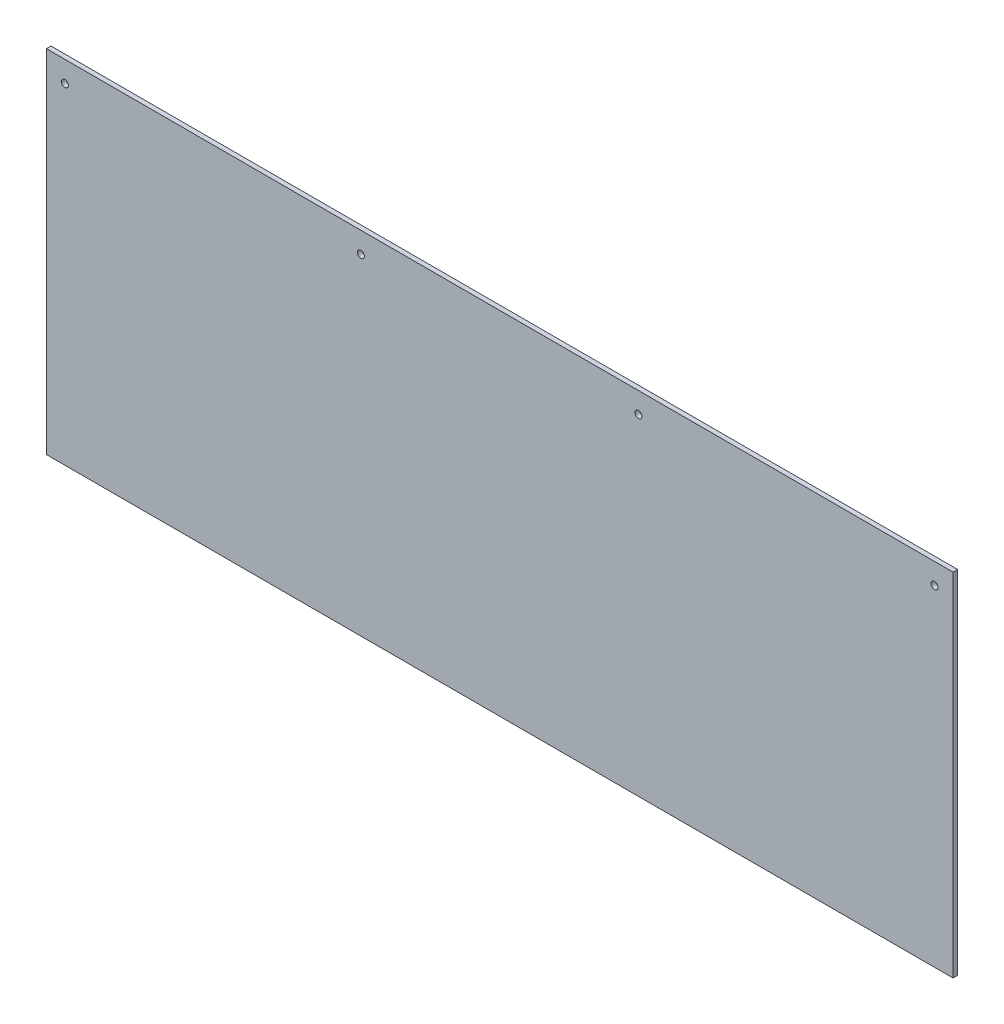
ISO-10303-21;
HEADER;
FILE_DESCRIPTION(('STEP AP214'),'2;1');
FILE_NAME('part.step','',(''),(''),'','','');
FILE_SCHEMA(('AUTOMOTIVE_DESIGN { 1 0 10303 214 1 1 1 1 }'));
ENDSEC;
DATA;
#1=APPLICATION_CONTEXT('core data for automotive mechanical design processes');
#2=APPLICATION_PROTOCOL_DEFINITION('international standard','automotive_design',2000,#1);
#3=PRODUCT_CONTEXT('',#1,'mechanical');
#4=PRODUCT('Part','Part','',(#3));
#5=PRODUCT_RELATED_PRODUCT_CATEGORY('part','',(#4));
#6=PRODUCT_DEFINITION_FORMATION('','',#4);
#7=PRODUCT_DEFINITION_CONTEXT('part definition',#1,'design');
#8=PRODUCT_DEFINITION('design','',#6,#7);
#9=PRODUCT_DEFINITION_SHAPE('','',#8);
#10=(LENGTH_UNIT() NAMED_UNIT(*) SI_UNIT(.MILLI.,.METRE.));
#11=(NAMED_UNIT(*) PLANE_ANGLE_UNIT() SI_UNIT($,.RADIAN.));
#12=(NAMED_UNIT(*) SI_UNIT($,.STERADIAN.) SOLID_ANGLE_UNIT());
#13=UNCERTAINTY_MEASURE_WITH_UNIT(LENGTH_MEASURE(1.E-05),#10,'distance_accuracy_value','');
#14=(GEOMETRIC_REPRESENTATION_CONTEXT(3) GLOBAL_UNCERTAINTY_ASSIGNED_CONTEXT((#13)) GLOBAL_UNIT_ASSIGNED_CONTEXT((#10,
#11,#12)) REPRESENTATION_CONTEXT('',''));
#15=CARTESIAN_POINT('',(0.,0.,0.));
#16=DIRECTION('',(0.,0.,1.));
#17=DIRECTION('',(1.,0.,0.));
#18=AXIS2_PLACEMENT_3D('',#15,#16,#17);
#19=CARTESIAN_POINT('',(0.,0.,6.35));
#20=DIRECTION('',(0.,0.,1.));
#21=DIRECTION('',(1.,0.,0.));
#22=AXIS2_PLACEMENT_3D('',#19,#20,#21);
#23=PLANE('',#22);
#24=CARTESIAN_POINT('',(1219.2,454.025,6.35));
#25=DIRECTION('',(0.,0.,1.));
#26=DIRECTION('',(1.,0.,0.));
#27=AXIS2_PLACEMENT_3D('',#24,#25,#26);
#28=CIRCLE('',#27,4.7625);
#29=CARTESIAN_POINT('',(1223.9625,454.025,6.35));
#30=VERTEX_POINT('',#29);
#31=EDGE_CURVE('E91',#30,#30,#28,.F.);
#32=ORIENTED_EDGE('',*,*,#31,.T.);
#33=EDGE_LOOP('',(#32));
#34=FACE_BOUND('',#33,.T.);
#35=CARTESIAN_POINT('',(812.8,454.025,6.35));
#36=DIRECTION('',(0.,0.,1.));
#37=DIRECTION('',(1.,0.,0.));
#38=AXIS2_PLACEMENT_3D('',#35,#36,#37);
#39=CIRCLE('',#38,4.7625);
#40=CARTESIAN_POINT('',(817.5625,454.025,6.35));
#41=VERTEX_POINT('',#40);
#42=EDGE_CURVE('E94',#41,#41,#39,.F.);
#43=ORIENTED_EDGE('',*,*,#42,.T.);
#44=EDGE_LOOP('',(#43));
#45=FACE_BOUND('',#44,.T.);
#46=CARTESIAN_POINT('',(431.8,454.025,6.35));
#47=DIRECTION('',(0.,0.,1.));
#48=DIRECTION('',(1.,0.,0.));
#49=AXIS2_PLACEMENT_3D('',#46,#47,#48);
#50=CIRCLE('',#49,4.7625);
#51=CARTESIAN_POINT('',(436.5625,454.025,6.35));
#52=VERTEX_POINT('',#51);
#53=EDGE_CURVE('E96',#52,#52,#50,.F.);
#54=ORIENTED_EDGE('',*,*,#53,.T.);
#55=EDGE_LOOP('',(#54));
#56=FACE_BOUND('',#55,.T.);
#57=CARTESIAN_POINT('',(25.4,454.025,6.35));
#58=DIRECTION('',(0.,0.,1.));
#59=DIRECTION('',(1.,0.,0.));
#60=AXIS2_PLACEMENT_3D('',#57,#58,#59);
#61=CIRCLE('',#60,4.7625);
#62=CARTESIAN_POINT('',(30.1625,454.025,6.35));
#63=VERTEX_POINT('',#62);
#64=EDGE_CURVE('E19',#63,#63,#61,.F.);
#65=ORIENTED_EDGE('',*,*,#64,.T.);
#66=EDGE_LOOP('',(#65));
#67=FACE_BOUND('',#66,.T.);
#68=DIRECTION('',(0.,1.,0.));
#69=VECTOR('',#68,1.);
#70=CARTESIAN_POINT('',(0.,482.6,6.35));
#71=LINE('',#70,#69);
#72=CARTESIAN_POINT('',(0.,0.,6.35));
#73=VERTEX_POINT('',#72);
#74=CARTESIAN_POINT('',(0.,482.6,6.35));
#75=VERTEX_POINT('',#74);
#76=EDGE_CURVE('E70',#73,#75,#71,.T.);
#77=ORIENTED_EDGE('',*,*,#76,.F.);
#78=DIRECTION('',(1.,0.,0.));
#79=VECTOR('',#78,1.);
#80=CARTESIAN_POINT('',(0.,0.,6.35));
#81=LINE('',#80,#79);
#82=CARTESIAN_POINT('',(1244.6,0.,6.35));
#83=VERTEX_POINT('',#82);
#84=EDGE_CURVE('E67',#83,#73,#81,.F.);
#85=ORIENTED_EDGE('',*,*,#84,.F.);
#86=DIRECTION('',(0.,1.,0.));
#87=VECTOR('',#86,1.);
#88=CARTESIAN_POINT('',(1244.6,0.,6.35));
#89=LINE('',#88,#87);
#90=CARTESIAN_POINT('',(1244.6,482.6,6.35));
#91=VERTEX_POINT('',#90);
#92=EDGE_CURVE('E58',#91,#83,#89,.F.);
#93=ORIENTED_EDGE('',*,*,#92,.F.);
#94=DIRECTION('',(1.,0.,0.));
#95=VECTOR('',#94,1.);
#96=CARTESIAN_POINT('',(1244.6,482.6,6.35));
#97=LINE('',#96,#95);
#98=EDGE_CURVE('E53',#75,#91,#97,.T.);
#99=ORIENTED_EDGE('',*,*,#98,.F.);
#100=EDGE_LOOP('',(#77,#85,#93,#99));
#101=FACE_BOUND('',#100,.T.);
#102=ADVANCED_FACE('F16',(#34,#45,#56,#67,#101),#23,.T.);
#103=CARTESIAN_POINT('',(0.,0.,0.));
#104=DIRECTION('',(0.,-1.,0.));
#105=DIRECTION('',(0.,0.,-1.));
#106=AXIS2_PLACEMENT_3D('',#103,#104,#105);
#107=PLANE('',#106);
#108=DIRECTION('',(0.,0.,1.));
#109=VECTOR('',#108,1.);
#110=CARTESIAN_POINT('',(0.,0.,0.));
#111=LINE('',#110,#109);
#112=CARTESIAN_POINT('',(0.,0.,0.));
#113=VERTEX_POINT('',#112);
#114=EDGE_CURVE('E104',#113,#73,#111,.T.);
#115=ORIENTED_EDGE('',*,*,#114,.F.);
#116=DIRECTION('',(1.,0.,0.));
#117=VECTOR('',#116,1.);
#118=CARTESIAN_POINT('',(0.,0.,0.));
#119=LINE('',#118,#117);
#120=CARTESIAN_POINT('',(1244.6,0.,0.));
#121=VERTEX_POINT('',#120);
#122=EDGE_CURVE('E77',#113,#121,#119,.T.);
#123=ORIENTED_EDGE('',*,*,#122,.T.);
#124=DIRECTION('',(0.,0.,-1.));
#125=VECTOR('',#124,1.);
#126=CARTESIAN_POINT('',(1244.6,0.,0.));
#127=LINE('',#126,#125);
#128=EDGE_CURVE('E63',#83,#121,#127,.T.);
#129=ORIENTED_EDGE('',*,*,#128,.F.);
#130=ORIENTED_EDGE('',*,*,#84,.T.);
#131=EDGE_LOOP('',(#115,#123,#129,#130));
#132=FACE_BOUND('',#131,.T.);
#133=ADVANCED_FACE('F76',(#132),#107,.T.);
#134=CARTESIAN_POINT('',(1244.6,0.,0.));
#135=DIRECTION('',(1.,0.,0.));
#136=DIRECTION('',(0.,0.,-1.));
#137=AXIS2_PLACEMENT_3D('',#134,#135,#136);
#138=PLANE('',#137);
#139=ORIENTED_EDGE('',*,*,#128,.T.);
#140=DIRECTION('',(0.,1.,0.));
#141=VECTOR('',#140,1.);
#142=CARTESIAN_POINT('',(1244.6,0.,0.));
#143=LINE('',#142,#141);
#144=CARTESIAN_POINT('',(1244.6,482.6,0.));
#145=VERTEX_POINT('',#144);
#146=EDGE_CURVE('E115',#121,#145,#143,.T.);
#147=ORIENTED_EDGE('',*,*,#146,.T.);
#148=DIRECTION('',(0.,0.,1.));
#149=VECTOR('',#148,1.);
#150=CARTESIAN_POINT('',(1244.6,482.6,0.));
#151=LINE('',#150,#149);
#152=EDGE_CURVE('E65',#91,#145,#151,.F.);
#153=ORIENTED_EDGE('',*,*,#152,.F.);
#154=ORIENTED_EDGE('',*,*,#92,.T.);
#155=EDGE_LOOP('',(#139,#147,#153,#154));
#156=FACE_BOUND('',#155,.T.);
#157=ADVANCED_FACE('F60',(#156),#138,.T.);
#158=CARTESIAN_POINT('',(1244.6,482.6,0.));
#159=DIRECTION('',(0.,1.,0.));
#160=DIRECTION('',(0.,0.,1.));
#161=AXIS2_PLACEMENT_3D('',#158,#159,#160);
#162=PLANE('',#161);
#163=ORIENTED_EDGE('',*,*,#152,.T.);
#164=DIRECTION('',(1.,0.,0.));
#165=VECTOR('',#164,1.);
#166=CARTESIAN_POINT('',(0.,482.6,0.));
#167=LINE('',#166,#165);
#168=CARTESIAN_POINT('',(0.,482.6,0.));
#169=VERTEX_POINT('',#168);
#170=EDGE_CURVE('E112',#145,#169,#167,.F.);
#171=ORIENTED_EDGE('',*,*,#170,.T.);
#172=DIRECTION('',(0.,0.,1.));
#173=VECTOR('',#172,1.);
#174=CARTESIAN_POINT('',(0.,482.6,0.));
#175=LINE('',#174,#173);
#176=EDGE_CURVE('E34',#75,#169,#175,.F.);
#177=ORIENTED_EDGE('',*,*,#176,.F.);
#178=ORIENTED_EDGE('',*,*,#98,.T.);
#179=EDGE_LOOP('',(#163,#171,#177,#178));
#180=FACE_BOUND('',#179,.T.);
#181=ADVANCED_FACE('F111',(#180),#162,.T.);
#182=CARTESIAN_POINT('',(0.,482.6,0.));
#183=DIRECTION('',(-1.,0.,0.));
#184=DIRECTION('',(0.,0.,1.));
#185=AXIS2_PLACEMENT_3D('',#182,#183,#184);
#186=PLANE('',#185);
#187=ORIENTED_EDGE('',*,*,#176,.T.);
#188=DIRECTION('',(0.,1.,0.));
#189=VECTOR('',#188,1.);
#190=CARTESIAN_POINT('',(0.,0.,0.));
#191=LINE('',#190,#189);
#192=EDGE_CURVE('E90',#169,#113,#191,.F.);
#193=ORIENTED_EDGE('',*,*,#192,.T.);
#194=ORIENTED_EDGE('',*,*,#114,.T.);
#195=ORIENTED_EDGE('',*,*,#76,.T.);
#196=EDGE_LOOP('',(#187,#193,#194,#195));
#197=FACE_BOUND('',#196,.T.);
#198=ADVANCED_FACE('F118',(#197),#186,.T.);
#199=CARTESIAN_POINT('',(25.4,454.025,0.));
#200=DIRECTION('',(0.,0.,1.));
#201=DIRECTION('',(1.,0.,0.));
#202=AXIS2_PLACEMENT_3D('',#199,#200,#201);
#203=CYLINDRICAL_SURFACE('',#202,4.7625);
#204=ORIENTED_EDGE('',*,*,#64,.F.);
#205=EDGE_LOOP('',(#204));
#206=FACE_BOUND('',#205,.T.);
#207=CARTESIAN_POINT('',(25.4,454.025,0.));
#208=DIRECTION('',(0.,0.,1.));
#209=DIRECTION('',(1.,0.,0.));
#210=AXIS2_PLACEMENT_3D('',#207,#208,#209);
#211=CIRCLE('',#210,4.7625);
#212=CARTESIAN_POINT('',(30.1625,454.025,0.));
#213=VERTEX_POINT('',#212);
#214=EDGE_CURVE('E87',#213,#213,#211,.F.);
#215=ORIENTED_EDGE('',*,*,#214,.T.);
#216=EDGE_LOOP('',(#215));
#217=FACE_BOUND('',#216,.T.);
#218=ADVANCED_FACE('F120',(#206,#217),#203,.F.);
#219=CARTESIAN_POINT('',(431.8,454.025,0.));
#220=DIRECTION('',(0.,0.,1.));
#221=DIRECTION('',(1.,0.,0.));
#222=AXIS2_PLACEMENT_3D('',#219,#220,#221);
#223=CYLINDRICAL_SURFACE('',#222,4.7625);
#224=ORIENTED_EDGE('',*,*,#53,.F.);
#225=EDGE_LOOP('',(#224));
#226=FACE_BOUND('',#225,.T.);
#227=CARTESIAN_POINT('',(431.8,454.025,0.));
#228=DIRECTION('',(0.,0.,1.));
#229=DIRECTION('',(1.,0.,0.));
#230=AXIS2_PLACEMENT_3D('',#227,#228,#229);
#231=CIRCLE('',#230,4.7625);
#232=CARTESIAN_POINT('',(436.5625,454.025,0.));
#233=VERTEX_POINT('',#232);
#234=EDGE_CURVE('E84',#233,#233,#231,.F.);
#235=ORIENTED_EDGE('',*,*,#234,.T.);
#236=EDGE_LOOP('',(#235));
#237=FACE_BOUND('',#236,.T.);
#238=ADVANCED_FACE('F127',(#226,#237),#223,.F.);
#239=CARTESIAN_POINT('',(812.8,454.025,0.));
#240=DIRECTION('',(0.,0.,1.));
#241=DIRECTION('',(1.,0.,0.));
#242=AXIS2_PLACEMENT_3D('',#239,#240,#241);
#243=CYLINDRICAL_SURFACE('',#242,4.7625);
#244=ORIENTED_EDGE('',*,*,#42,.F.);
#245=EDGE_LOOP('',(#244));
#246=FACE_BOUND('',#245,.T.);
#247=CARTESIAN_POINT('',(812.8,454.025,0.));
#248=DIRECTION('',(0.,0.,1.));
#249=DIRECTION('',(1.,0.,0.));
#250=AXIS2_PLACEMENT_3D('',#247,#248,#249);
#251=CIRCLE('',#250,4.7625);
#252=CARTESIAN_POINT('',(817.5625,454.025,0.));
#253=VERTEX_POINT('',#252);
#254=EDGE_CURVE('E25',#253,#253,#251,.F.);
#255=ORIENTED_EDGE('',*,*,#254,.T.);
#256=EDGE_LOOP('',(#255));
#257=FACE_BOUND('',#256,.T.);
#258=ADVANCED_FACE('F138',(#246,#257),#243,.F.);
#259=CARTESIAN_POINT('',(1219.2,454.025,0.));
#260=DIRECTION('',(0.,0.,1.));
#261=DIRECTION('',(1.,0.,0.));
#262=AXIS2_PLACEMENT_3D('',#259,#260,#261);
#263=CYLINDRICAL_SURFACE('',#262,4.7625);
#264=ORIENTED_EDGE('',*,*,#31,.F.);
#265=EDGE_LOOP('',(#264));
#266=FACE_BOUND('',#265,.T.);
#267=CARTESIAN_POINT('',(1219.2,454.025,0.));
#268=DIRECTION('',(0.,0.,1.));
#269=DIRECTION('',(1.,0.,0.));
#270=AXIS2_PLACEMENT_3D('',#267,#268,#269);
#271=CIRCLE('',#270,4.7625);
#272=CARTESIAN_POINT('',(1223.9625,454.025,0.));
#273=VERTEX_POINT('',#272);
#274=EDGE_CURVE('E11',#273,#273,#271,.F.);
#275=ORIENTED_EDGE('',*,*,#274,.T.);
#276=EDGE_LOOP('',(#275));
#277=FACE_BOUND('',#276,.T.);
#278=ADVANCED_FACE('F132',(#266,#277),#263,.F.);
#279=CARTESIAN_POINT('',(0.,0.,0.));
#280=DIRECTION('',(0.,0.,1.));
#281=DIRECTION('',(1.,0.,0.));
#282=AXIS2_PLACEMENT_3D('',#279,#280,#281);
#283=PLANE('',#282);
#284=ORIENTED_EDGE('',*,*,#274,.F.);
#285=EDGE_LOOP('',(#284));
#286=FACE_BOUND('',#285,.T.);
#287=ORIENTED_EDGE('',*,*,#254,.F.);
#288=EDGE_LOOP('',(#287));
#289=FACE_BOUND('',#288,.T.);
#290=ORIENTED_EDGE('',*,*,#234,.F.);
#291=EDGE_LOOP('',(#290));
#292=FACE_BOUND('',#291,.T.);
#293=ORIENTED_EDGE('',*,*,#214,.F.);
#294=EDGE_LOOP('',(#293));
#295=FACE_BOUND('',#294,.T.);
#296=ORIENTED_EDGE('',*,*,#170,.F.);
#297=ORIENTED_EDGE('',*,*,#146,.F.);
#298=ORIENTED_EDGE('',*,*,#122,.F.);
#299=ORIENTED_EDGE('',*,*,#192,.F.);
#300=EDGE_LOOP('',(#296,#297,#298,#299));
#301=FACE_BOUND('',#300,.T.);
#302=ADVANCED_FACE('F114',(#286,#289,#292,#295,#301),#283,.F.);
#303=CLOSED_SHELL('',(#102,#133,#157,#181,#198,#218,#238,#258,#278,#302));
#304=MANIFOLD_SOLID_BREP('B1',#303);
#305=ADVANCED_BREP_SHAPE_REPRESENTATION('',(#18,#304),#14);
#306=SHAPE_DEFINITION_REPRESENTATION(#9,#305);
ENDSEC;
END-ISO-10303-21;
